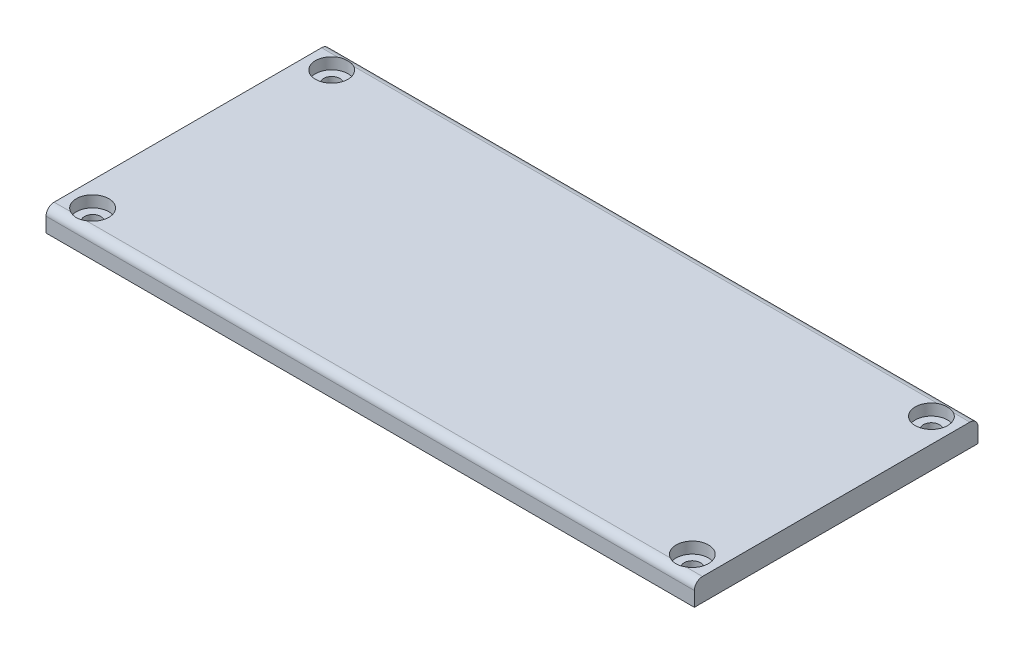
ISO-10303-21;
HEADER;
FILE_DESCRIPTION(('STEP AP214'),'2;1');
FILE_NAME('part.step','',(''),(''),'','','');
FILE_SCHEMA(('AUTOMOTIVE_DESIGN { 1 0 10303 214 1 1 1 1 }'));
ENDSEC;
DATA;
#1=APPLICATION_CONTEXT('core data for automotive mechanical design processes');
#2=APPLICATION_PROTOCOL_DEFINITION('international standard','automotive_design',2000,#1);
#3=PRODUCT_CONTEXT('',#1,'mechanical');
#4=PRODUCT('Part','Part','',(#3));
#5=PRODUCT_RELATED_PRODUCT_CATEGORY('part','',(#4));
#6=PRODUCT_DEFINITION_FORMATION('','',#4);
#7=PRODUCT_DEFINITION_CONTEXT('part definition',#1,'design');
#8=PRODUCT_DEFINITION('design','',#6,#7);
#9=PRODUCT_DEFINITION_SHAPE('','',#8);
#10=(LENGTH_UNIT() NAMED_UNIT(*) SI_UNIT(.MILLI.,.METRE.));
#11=(NAMED_UNIT(*) PLANE_ANGLE_UNIT() SI_UNIT($,.RADIAN.));
#12=(NAMED_UNIT(*) SI_UNIT($,.STERADIAN.) SOLID_ANGLE_UNIT());
#13=UNCERTAINTY_MEASURE_WITH_UNIT(LENGTH_MEASURE(1.E-05),#10,'distance_accuracy_value','');
#14=(GEOMETRIC_REPRESENTATION_CONTEXT(3) GLOBAL_UNCERTAINTY_ASSIGNED_CONTEXT((#13)) GLOBAL_UNIT_ASSIGNED_CONTEXT((#10,
#11,#12)) REPRESENTATION_CONTEXT('',''));
#15=CARTESIAN_POINT('',(0.,0.,0.));
#16=DIRECTION('',(0.,0.,1.));
#17=DIRECTION('',(1.,0.,0.));
#18=AXIS2_PLACEMENT_3D('',#15,#16,#17);
#19=CARTESIAN_POINT('',(-21.1045649137268,1.4,-6.99518001551933));
#20=DIRECTION('',(1.,0.,0.));
#21=DIRECTION('',(0.,0.,-1.));
#22=AXIS2_PLACEMENT_3D('',#19,#20,#21);
#23=PLANE('',#22);
#24=DIRECTION('',(0.,-1.,0.));
#25=VECTOR('',#24,1.);
#26=CARTESIAN_POINT('',(-21.1045649137268,1.4,10.5048199844807));
#27=LINE('',#26,#25);
#28=CARTESIAN_POINT('',(-21.1045649137268,0.9,10.5048199844807));
#29=VERTEX_POINT('',#28);
#30=CARTESIAN_POINT('',(-21.1045649137268,0.,10.5048199844807));
#31=VERTEX_POINT('',#30);
#32=EDGE_CURVE('E173',#29,#31,#27,.T.);
#33=ORIENTED_EDGE('',*,*,#32,.F.);
#34=CARTESIAN_POINT('',(-21.1045649137268,0.9,10.0048199844807));
#35=DIRECTION('',(1.,0.,0.));
#36=DIRECTION('',(0.,0.,-1.));
#37=AXIS2_PLACEMENT_3D('',#34,#35,#36);
#38=CIRCLE('',#37,0.5);
#39=CARTESIAN_POINT('',(-21.1045649137268,1.4,10.0048199844807));
#40=VERTEX_POINT('',#39);
#41=EDGE_CURVE('E12',#29,#40,#38,.F.);
#42=ORIENTED_EDGE('',*,*,#41,.T.);
#43=DIRECTION('',(0.,0.,1.));
#44=VECTOR('',#43,1.);
#45=CARTESIAN_POINT('',(-21.1045649137268,1.4,-6.99518001551933));
#46=LINE('',#45,#44);
#47=CARTESIAN_POINT('',(-21.1045649137268,1.4,-6.49518001551933));
#48=VERTEX_POINT('',#47);
#49=EDGE_CURVE('E207',#48,#40,#46,.T.);
#50=ORIENTED_EDGE('',*,*,#49,.F.);
#51=CARTESIAN_POINT('',(-21.1045649137268,0.9,-6.49518001551933));
#52=DIRECTION('',(1.,0.,0.));
#53=DIRECTION('',(0.,0.,-1.));
#54=AXIS2_PLACEMENT_3D('',#51,#52,#53);
#55=CIRCLE('',#54,0.5);
#56=CARTESIAN_POINT('',(-21.1045649137268,0.9,-6.99518001551933));
#57=VERTEX_POINT('',#56);
#58=EDGE_CURVE('E368',#48,#57,#55,.F.);
#59=ORIENTED_EDGE('',*,*,#58,.T.);
#60=DIRECTION('',(0.,-1.,0.));
#61=VECTOR('',#60,1.);
#62=CARTESIAN_POINT('',(-21.1045649137268,1.4,-6.99518001551933));
#63=LINE('',#62,#61);
#64=CARTESIAN_POINT('',(-21.1045649137268,0.,-6.99518001551933));
#65=VERTEX_POINT('',#64);
#66=EDGE_CURVE('E193',#57,#65,#63,.T.);
#67=ORIENTED_EDGE('',*,*,#66,.T.);
#68=DIRECTION('',(0.,0.,1.));
#69=VECTOR('',#68,1.);
#70=CARTESIAN_POINT('',(-21.1045649137268,0.,-6.99518001551933));
#71=LINE('',#70,#69);
#72=EDGE_CURVE('E188',#65,#31,#71,.T.);
#73=ORIENTED_EDGE('',*,*,#72,.T.);
#74=EDGE_LOOP('',(#33,#42,#50,#59,#67,#73));
#75=FACE_BOUND('',#74,.T.);
#76=ADVANCED_FACE('F98',(#75),#23,.F.);
#77=CARTESIAN_POINT('',(-21.1045649137268,1.4,10.5048199844807));
#78=DIRECTION('',(0.,0.,-1.));
#79=DIRECTION('',(-1.,0.,0.));
#80=AXIS2_PLACEMENT_3D('',#77,#78,#79);
#81=PLANE('',#80);
#82=DIRECTION('',(0.,-1.,0.));
#83=VECTOR('',#82,1.);
#84=CARTESIAN_POINT('',(18.8954350862732,1.4,10.5048199844807));
#85=LINE('',#84,#83);
#86=CARTESIAN_POINT('',(18.8954350862732,0.9,10.5048199844807));
#87=VERTEX_POINT('',#86);
#88=CARTESIAN_POINT('',(18.8954350862732,0.,10.5048199844807));
#89=VERTEX_POINT('',#88);
#90=EDGE_CURVE('E182',#87,#89,#85,.T.);
#91=ORIENTED_EDGE('',*,*,#90,.F.);
#92=DIRECTION('',(1.,0.,0.));
#93=VECTOR('',#92,1.);
#94=CARTESIAN_POINT('',(-21.1045649137268,0.9,10.5048199844807));
#95=LINE('',#94,#93);
#96=EDGE_CURVE('E107',#87,#29,#95,.F.);
#97=ORIENTED_EDGE('',*,*,#96,.T.);
#98=ORIENTED_EDGE('',*,*,#32,.T.);
#99=DIRECTION('',(1.,0.,0.));
#100=VECTOR('',#99,1.);
#101=CARTESIAN_POINT('',(-21.1045649137268,0.,10.5048199844807));
#102=LINE('',#101,#100);
#103=EDGE_CURVE('E176',#31,#89,#102,.T.);
#104=ORIENTED_EDGE('',*,*,#103,.T.);
#105=EDGE_LOOP('',(#91,#97,#98,#104));
#106=FACE_BOUND('',#105,.T.);
#107=ADVANCED_FACE('F175',(#106),#81,.F.);
#108=CARTESIAN_POINT('',(18.8954350862732,1.4,-6.99518001551933));
#109=DIRECTION('',(-1.,0.,0.));
#110=DIRECTION('',(0.,0.,1.));
#111=AXIS2_PLACEMENT_3D('',#108,#109,#110);
#112=PLANE('',#111);
#113=DIRECTION('',(0.,0.,-1.));
#114=VECTOR('',#113,1.);
#115=CARTESIAN_POINT('',(18.8954350862732,1.4,-6.99518001551933));
#116=LINE('',#115,#114);
#117=CARTESIAN_POINT('',(18.8954350862732,1.4,10.0048199844807));
#118=VERTEX_POINT('',#117);
#119=CARTESIAN_POINT('',(18.8954350862732,1.4,-6.49518001551933));
#120=VERTEX_POINT('',#119);
#121=EDGE_CURVE('E201',#118,#120,#116,.T.);
#122=ORIENTED_EDGE('',*,*,#121,.F.);
#123=CARTESIAN_POINT('',(18.8954350862732,0.9,10.0048199844807));
#124=DIRECTION('',(-1.,0.,0.));
#125=DIRECTION('',(0.,0.,1.));
#126=AXIS2_PLACEMENT_3D('',#123,#124,#125);
#127=CIRCLE('',#126,0.5);
#128=EDGE_CURVE('E121',#118,#87,#127,.F.);
#129=ORIENTED_EDGE('',*,*,#128,.T.);
#130=ORIENTED_EDGE('',*,*,#90,.T.);
#131=DIRECTION('',(0.,0.,-1.));
#132=VECTOR('',#131,1.);
#133=CARTESIAN_POINT('',(18.8954350862732,0.,-6.99518001551933));
#134=LINE('',#133,#132);
#135=CARTESIAN_POINT('',(18.8954350862732,0.,-6.99518001551933));
#136=VERTEX_POINT('',#135);
#137=EDGE_CURVE('E190',#89,#136,#134,.T.);
#138=ORIENTED_EDGE('',*,*,#137,.T.);
#139=DIRECTION('',(0.,-1.,0.));
#140=VECTOR('',#139,1.);
#141=CARTESIAN_POINT('',(18.8954350862732,1.4,-6.99518001551933));
#142=LINE('',#141,#140);
#143=CARTESIAN_POINT('',(18.8954350862732,0.9,-6.99518001551933));
#144=VERTEX_POINT('',#143);
#145=EDGE_CURVE('E209',#144,#136,#142,.T.);
#146=ORIENTED_EDGE('',*,*,#145,.F.);
#147=CARTESIAN_POINT('',(18.8954350862732,0.9,-6.49518001551933));
#148=DIRECTION('',(-1.,0.,0.));
#149=DIRECTION('',(0.,0.,1.));
#150=AXIS2_PLACEMENT_3D('',#147,#148,#149);
#151=CIRCLE('',#150,0.5);
#152=EDGE_CURVE('E357',#144,#120,#151,.F.);
#153=ORIENTED_EDGE('',*,*,#152,.T.);
#154=EDGE_LOOP('',(#122,#129,#130,#138,#146,#153));
#155=FACE_BOUND('',#154,.T.);
#156=ADVANCED_FACE('F245',(#155),#112,.F.);
#157=CARTESIAN_POINT('',(-21.1045649137268,1.4,-6.99518001551933));
#158=DIRECTION('',(0.,0.,1.));
#159=DIRECTION('',(1.,0.,0.));
#160=AXIS2_PLACEMENT_3D('',#157,#158,#159);
#161=PLANE('',#160);
#162=ORIENTED_EDGE('',*,*,#66,.F.);
#163=DIRECTION('',(-1.,0.,0.));
#164=VECTOR('',#163,1.);
#165=CARTESIAN_POINT('',(18.8954350862732,0.9,-6.99518001551933));
#166=LINE('',#165,#164);
#167=EDGE_CURVE('E359',#57,#144,#166,.F.);
#168=ORIENTED_EDGE('',*,*,#167,.T.);
#169=ORIENTED_EDGE('',*,*,#145,.T.);
#170=DIRECTION('',(-1.,0.,0.));
#171=VECTOR('',#170,1.);
#172=CARTESIAN_POINT('',(-21.1045649137268,0.,-6.99518001551933));
#173=LINE('',#172,#171);
#174=EDGE_CURVE('E205',#136,#65,#173,.T.);
#175=ORIENTED_EDGE('',*,*,#174,.T.);
#176=EDGE_LOOP('',(#162,#168,#169,#175));
#177=FACE_BOUND('',#176,.T.);
#178=ADVANCED_FACE('F248',(#177),#161,.F.);
#179=CARTESIAN_POINT('',(0.,1.4,0.));
#180=DIRECTION('',(0.,1.,0.));
#181=DIRECTION('',(0.,0.,1.));
#182=AXIS2_PLACEMENT_3D('',#179,#180,#181);
#183=PLANE('',#182);
#184=ORIENTED_EDGE('',*,*,#49,.T.);
#185=DIRECTION('',(1.,0.,0.));
#186=VECTOR('',#185,1.);
#187=CARTESIAN_POINT('',(18.8954350862732,1.4,10.0048199844807));
#188=LINE('',#187,#186);
#189=CARTESIAN_POINT('',(-20.0886878320027,1.4,10.0048199844807));
#190=VERTEX_POINT('',#189);
#191=EDGE_CURVE('E285',#40,#190,#188,.T.);
#192=ORIENTED_EDGE('',*,*,#191,.T.);
#193=CARTESIAN_POINT('',(-19.6045649137268,1.4,9.12981998448067));
#194=DIRECTION('',(0.,-1.,0.));
#195=DIRECTION('',(0.,0.,-1.));
#196=AXIS2_PLACEMENT_3D('',#193,#194,#195);
#197=CIRCLE('',#196,1.);
#198=CARTESIAN_POINT('',(-19.1204419954508,1.4,10.0048199844807));
#199=VERTEX_POINT('',#198);
#200=EDGE_CURVE('E332',#190,#199,#197,.T.);
#201=ORIENTED_EDGE('',*,*,#200,.T.);
#202=DIRECTION('',(1.,0.,0.));
#203=VECTOR('',#202,1.);
#204=CARTESIAN_POINT('',(18.8954350862732,1.4,10.0048199844807));
#205=LINE('',#204,#203);
#206=CARTESIAN_POINT('',(16.9113121679973,1.4,10.0048199844807));
#207=VERTEX_POINT('',#206);
#208=EDGE_CURVE('E371',#199,#207,#205,.T.);
#209=ORIENTED_EDGE('',*,*,#208,.T.);
#210=CARTESIAN_POINT('',(17.3954350862732,1.4,9.12981998448067));
#211=DIRECTION('',(0.,1.,0.));
#212=DIRECTION('',(0.,0.,-1.));
#213=AXIS2_PLACEMENT_3D('',#210,#211,#212);
#214=CIRCLE('',#213,1.);
#215=CARTESIAN_POINT('',(17.8795580045492,1.4,10.0048199844807));
#216=VERTEX_POINT('',#215);
#217=EDGE_CURVE('E379',#216,#207,#214,.T.);
#218=ORIENTED_EDGE('',*,*,#217,.F.);
#219=DIRECTION('',(1.,0.,0.));
#220=VECTOR('',#219,1.);
#221=CARTESIAN_POINT('',(18.8954350862732,1.4,10.0048199844807));
#222=LINE('',#221,#220);
#223=EDGE_CURVE('E354',#216,#118,#222,.T.);
#224=ORIENTED_EDGE('',*,*,#223,.T.);
#225=ORIENTED_EDGE('',*,*,#121,.T.);
#226=DIRECTION('',(-1.,0.,0.));
#227=VECTOR('',#226,1.);
#228=CARTESIAN_POINT('',(-21.1045649137268,1.4,-6.49518001551933));
#229=LINE('',#228,#227);
#230=CARTESIAN_POINT('',(17.8795580045492,1.4,-6.49518001551933));
#231=VERTEX_POINT('',#230);
#232=EDGE_CURVE('E215',#120,#231,#229,.T.);
#233=ORIENTED_EDGE('',*,*,#232,.T.);
#234=CARTESIAN_POINT('',(17.3954350862732,1.4,-5.62018001551933));
#235=DIRECTION('',(0.,-1.,0.));
#236=DIRECTION('',(0.,0.,1.));
#237=AXIS2_PLACEMENT_3D('',#234,#235,#236);
#238=CIRCLE('',#237,1.);
#239=CARTESIAN_POINT('',(16.9113121679973,1.4,-6.49518001551933));
#240=VERTEX_POINT('',#239);
#241=EDGE_CURVE('E319',#231,#240,#238,.T.);
#242=ORIENTED_EDGE('',*,*,#241,.T.);
#243=DIRECTION('',(-1.,0.,0.));
#244=VECTOR('',#243,1.);
#245=CARTESIAN_POINT('',(-21.1045649137268,1.4,-6.49518001551933));
#246=LINE('',#245,#244);
#247=CARTESIAN_POINT('',(-19.1204419954508,1.4,-6.49518001551933));
#248=VERTEX_POINT('',#247);
#249=EDGE_CURVE('E213',#240,#248,#246,.T.);
#250=ORIENTED_EDGE('',*,*,#249,.T.);
#251=CARTESIAN_POINT('',(-19.6045649137268,1.4,-5.62018001551933));
#252=DIRECTION('',(0.,1.,0.));
#253=DIRECTION('',(0.,0.,1.));
#254=AXIS2_PLACEMENT_3D('',#251,#252,#253);
#255=CIRCLE('',#254,1.);
#256=CARTESIAN_POINT('',(-20.0886878320027,1.4,-6.49518001551933));
#257=VERTEX_POINT('',#256);
#258=EDGE_CURVE('E198',#257,#248,#255,.T.);
#259=ORIENTED_EDGE('',*,*,#258,.F.);
#260=DIRECTION('',(-1.,0.,0.));
#261=VECTOR('',#260,1.);
#262=CARTESIAN_POINT('',(-21.1045649137268,1.4,-6.49518001551933));
#263=LINE('',#262,#261);
#264=EDGE_CURVE('E181',#257,#48,#263,.T.);
#265=ORIENTED_EDGE('',*,*,#264,.T.);
#266=EDGE_LOOP('',(#184,#192,#201,#209,#218,#224,#225,#233,#242,#250,#259,#265));
#267=FACE_BOUND('',#266,.T.);
#268=ADVANCED_FACE('F251',(#267),#183,.T.);
#269=CARTESIAN_POINT('',(0.,0.,0.));
#270=DIRECTION('',(0.,1.,0.));
#271=DIRECTION('',(0.,0.,1.));
#272=AXIS2_PLACEMENT_3D('',#269,#270,#271);
#273=PLANE('',#272);
#274=CARTESIAN_POINT('',(17.3954350862732,0.,9.12981998448067));
#275=DIRECTION('',(0.,1.,0.));
#276=DIRECTION('',(0.,0.,1.));
#277=AXIS2_PLACEMENT_3D('',#274,#275,#276);
#278=CIRCLE('',#277,0.499999999999999);
#279=CARTESIAN_POINT('',(17.3954350862732,0.,9.62981998448067));
#280=VERTEX_POINT('',#279);
#281=EDGE_CURVE('E381',#280,#280,#278,.T.);
#282=ORIENTED_EDGE('',*,*,#281,.T.);
#283=EDGE_LOOP('',(#282));
#284=FACE_BOUND('',#283,.T.);
#285=CARTESIAN_POINT('',(17.3954350862732,0.,-5.62018001551933));
#286=DIRECTION('',(0.,1.,0.));
#287=DIRECTION('',(0.,0.,1.));
#288=AXIS2_PLACEMENT_3D('',#285,#286,#287);
#289=CIRCLE('',#288,0.499999999999999);
#290=CARTESIAN_POINT('',(17.3954350862732,0.,-5.12018001551933));
#291=VERTEX_POINT('',#290);
#292=EDGE_CURVE('E325',#291,#291,#289,.F.);
#293=ORIENTED_EDGE('',*,*,#292,.F.);
#294=EDGE_LOOP('',(#293));
#295=FACE_BOUND('',#294,.T.);
#296=CARTESIAN_POINT('',(-19.6045649137268,0.,9.12981998448067));
#297=DIRECTION('',(0.,1.,0.));
#298=DIRECTION('',(0.,0.,1.));
#299=AXIS2_PLACEMENT_3D('',#296,#297,#298);
#300=CIRCLE('',#299,0.499999999999999);
#301=CARTESIAN_POINT('',(-19.6045649137268,0.,9.62981998448067));
#302=VERTEX_POINT('',#301);
#303=EDGE_CURVE('E322',#302,#302,#300,.F.);
#304=ORIENTED_EDGE('',*,*,#303,.F.);
#305=EDGE_LOOP('',(#304));
#306=FACE_BOUND('',#305,.T.);
#307=CARTESIAN_POINT('',(-19.6045649137268,0.,-5.62018001551933));
#308=DIRECTION('',(0.,1.,0.));
#309=DIRECTION('',(0.,0.,1.));
#310=AXIS2_PLACEMENT_3D('',#307,#308,#309);
#311=CIRCLE('',#310,0.499999999999999);
#312=CARTESIAN_POINT('',(-19.6045649137268,0.,-5.12018001551933));
#313=VERTEX_POINT('',#312);
#314=EDGE_CURVE('E341',#313,#313,#311,.T.);
#315=ORIENTED_EDGE('',*,*,#314,.T.);
#316=EDGE_LOOP('',(#315));
#317=FACE_BOUND('',#316,.T.);
#318=ORIENTED_EDGE('',*,*,#72,.F.);
#319=ORIENTED_EDGE('',*,*,#174,.F.);
#320=ORIENTED_EDGE('',*,*,#137,.F.);
#321=ORIENTED_EDGE('',*,*,#103,.F.);
#322=EDGE_LOOP('',(#318,#319,#320,#321));
#323=FACE_BOUND('',#322,.T.);
#324=ADVANCED_FACE('F186',(#284,#295,#306,#317,#323),#273,.F.);
#325=CARTESIAN_POINT('',(-19.6045649137268,0.7,-5.62018001551933));
#326=DIRECTION('',(0.,1.,0.));
#327=DIRECTION('',(0.,0.,1.));
#328=AXIS2_PLACEMENT_3D('',#325,#326,#327);
#329=CYLINDRICAL_SURFACE('',#328,1.);
#330=CARTESIAN_POINT('',(-19.6045649137268,0.7,-5.62018001551933));
#331=DIRECTION('',(0.,1.,0.));
#332=DIRECTION('',(0.,0.,1.));
#333=AXIS2_PLACEMENT_3D('',#330,#331,#332);
#334=CIRCLE('',#333,1.);
#335=CARTESIAN_POINT('',(-19.6045649137268,0.7,-4.62018001551933));
#336=VERTEX_POINT('',#335);
#337=EDGE_CURVE('E195',#336,#336,#334,.T.);
#338=ORIENTED_EDGE('',*,*,#337,.F.);
#339=EDGE_LOOP('',(#338));
#340=FACE_BOUND('',#339,.T.);
#341=ORIENTED_EDGE('',*,*,#258,.T.);
#342=CARTESIAN_POINT('',(-19.1204419954508,1.4,-6.49518001551933));
#343=CARTESIAN_POINT('',(-19.1445879332908,1.39998974413526,-6.50854210294463));
#344=CARTESIAN_POINT('',(-19.1692778568295,1.39946448474708,-6.52089457041051));
#345=CARTESIAN_POINT('',(-19.2195692438282,1.39779049582453,-6.54350938798196));
#346=CARTESIAN_POINT('',(-19.2451704232282,1.39664195901738,-6.55377238283716));
#347=CARTESIAN_POINT('',(-19.2970774230511,1.39412965070228,-6.57212959293032));
#348=CARTESIAN_POINT('',(-19.3233819276203,1.39276626056713,-6.58022758372311));
#349=CARTESIAN_POINT('',(-19.3765677971149,1.39014160609788,-6.59423058936994));
#350=CARTESIAN_POINT('',(-19.4034491895771,1.38888034665261,-6.60013549929351));
#351=CARTESIAN_POINT('',(-19.4852408811027,1.38564340666151,-6.61458453044204));
#352=CARTESIAN_POINT('',(-19.5408266534271,1.38424752730245,-6.61969592620512));
#353=CARTESIAN_POINT('',(-19.6520841091063,1.38401528750251,-6.62059833923553));
#354=CARTESIAN_POINT('',(-19.7077557996667,1.38517915486502,-6.6163885269663));
#355=CARTESIAN_POINT('',(-19.7911090052383,1.3882424702987,-6.60305210143303));
#356=CARTESIAN_POINT('',(-19.8193891133225,1.38951996193624,-6.59725898700355));
#357=CARTESIAN_POINT('',(-19.8753434073437,1.39223468864341,-6.58325310619814));
#358=CARTESIAN_POINT('',(-19.9030175803742,1.39367192711169,-6.57504028833623));
#359=CARTESIAN_POINT('',(-19.9576235942742,1.39635077219216,-6.55622771728579));
#360=CARTESIAN_POINT('',(-19.9845535988334,1.39759192530831,-6.54562256476342));
#361=CARTESIAN_POINT('',(-20.0374179812289,1.39941037147826,-6.52210942785793));
#362=CARTESIAN_POINT('',(-20.0633521105882,1.39998749988079,-6.50920087324042));
#363=CARTESIAN_POINT('',(-20.0886878320027,1.4,-6.49518001551933));
#364=B_SPLINE_CURVE_WITH_KNOTS('',3,(#342,#343,#344,#345,#346,#347,#348,#349,#350,#351,#352,
#353,#354,#355,#356,#357,#358,#359,#360,#361,#362,#363),.UNSPECIFIED.,.F.,.F.,(4,2,2,2,2,2,2,2,
2,2,4),(0.,0.0827434879898214,0.165461404952534,0.248034114858824,0.330610775042443,
0.497250851029685,0.663905757668905,0.750501327398481,0.837098739825004,0.923893587526274,
1.0107099522031),.UNSPECIFIED.);
#365=EDGE_CURVE('E224',#248,#257,#364,.T.);
#366=ORIENTED_EDGE('',*,*,#365,.T.);
#367=EDGE_LOOP('',(#341,#366));
#368=FACE_BOUND('',#367,.T.);
#369=ADVANCED_FACE('F255',(#340,#368),#329,.F.);
#370=CARTESIAN_POINT('',(-19.6045649137268,0.7,-5.62018001551933));
#371=DIRECTION('',(0.,1.,0.));
#372=DIRECTION('',(0.,0.,1.));
#373=AXIS2_PLACEMENT_3D('',#370,#371,#372);
#374=PLANE('',#373);
#375=CARTESIAN_POINT('',(-19.6045649137268,0.7,-5.62018001551933));
#376=DIRECTION('',(0.,1.,0.));
#377=DIRECTION('',(0.,0.,1.));
#378=AXIS2_PLACEMENT_3D('',#375,#376,#377);
#379=CIRCLE('',#378,0.499999999999999);
#380=CARTESIAN_POINT('',(-19.6045649137268,0.7,-5.12018001551933));
#381=VERTEX_POINT('',#380);
#382=EDGE_CURVE('E336',#381,#381,#379,.T.);
#383=ORIENTED_EDGE('',*,*,#382,.F.);
#384=EDGE_LOOP('',(#383));
#385=FACE_BOUND('',#384,.T.);
#386=ORIENTED_EDGE('',*,*,#337,.T.);
#387=EDGE_LOOP('',(#386));
#388=FACE_BOUND('',#387,.T.);
#389=ADVANCED_FACE('F262',(#385,#388),#374,.T.);
#390=CARTESIAN_POINT('',(-19.6045649137268,-0.8,-5.62018001551933));
#391=DIRECTION('',(0.,1.,0.));
#392=DIRECTION('',(0.,0.,1.));
#393=AXIS2_PLACEMENT_3D('',#390,#391,#392);
#394=CYLINDRICAL_SURFACE('',#393,0.499999999999999);
#395=ORIENTED_EDGE('',*,*,#382,.T.);
#396=EDGE_LOOP('',(#395));
#397=FACE_BOUND('',#396,.T.);
#398=ORIENTED_EDGE('',*,*,#314,.F.);
#399=EDGE_LOOP('',(#398));
#400=FACE_BOUND('',#399,.T.);
#401=ADVANCED_FACE('F266',(#397,#400),#394,.F.);
#402=CARTESIAN_POINT('',(-19.6045649137268,0.7,9.12981998448067));
#403=DIRECTION('',(0.,1.,0.));
#404=DIRECTION('',(0.,0.,1.));
#405=AXIS2_PLACEMENT_3D('',#402,#403,#404);
#406=CYLINDRICAL_SURFACE('',#405,1.);
#407=CARTESIAN_POINT('',(-19.6045649137268,0.7,9.12981998448067));
#408=DIRECTION('',(0.,-1.,0.));
#409=DIRECTION('',(0.,0.,-1.));
#410=AXIS2_PLACEMENT_3D('',#407,#408,#409);
#411=CIRCLE('',#410,1.);
#412=CARTESIAN_POINT('',(-19.6045649137268,0.7,8.12981998448067));
#413=VERTEX_POINT('',#412);
#414=EDGE_CURVE('E333',#413,#413,#411,.T.);
#415=ORIENTED_EDGE('',*,*,#414,.T.);
#416=EDGE_LOOP('',(#415));
#417=FACE_BOUND('',#416,.T.);
#418=ORIENTED_EDGE('',*,*,#200,.F.);
#419=CARTESIAN_POINT('',(-20.0886878320027,1.4,10.0048199844807));
#420=CARTESIAN_POINT('',(-20.0645418941627,1.39998974413526,10.018182071906));
#421=CARTESIAN_POINT('',(-20.039851970624,1.39946448474708,10.0305345393718));
#422=CARTESIAN_POINT('',(-19.9895605836253,1.39779049582453,10.0531493569433));
#423=CARTESIAN_POINT('',(-19.9639594042253,1.39664195901739,10.0634123517985));
#424=CARTESIAN_POINT('',(-19.9120524044024,1.39412965070229,10.0817695618917));
#425=CARTESIAN_POINT('',(-19.8857478998332,1.39276626056713,10.0898675526844));
#426=CARTESIAN_POINT('',(-19.8325620303386,1.39014160609788,10.1038705583313));
#427=CARTESIAN_POINT('',(-19.8056806378764,1.38888034665261,10.1097754682548));
#428=CARTESIAN_POINT('',(-19.7238889463508,1.38564340666151,10.1242244994034));
#429=CARTESIAN_POINT('',(-19.6683031740264,1.38424752730245,10.1293358951665));
#430=CARTESIAN_POINT('',(-19.5570457183472,1.38401528750251,10.1302383081969));
#431=CARTESIAN_POINT('',(-19.5013740277868,1.38517915486502,10.1260284959276));
#432=CARTESIAN_POINT('',(-19.4180208222152,1.3882424702987,10.1126920703944));
#433=CARTESIAN_POINT('',(-19.389740714131,1.38951996193624,10.1068989559649));
#434=CARTESIAN_POINT('',(-19.3337864201098,1.39223468864341,10.0928930751595));
#435=CARTESIAN_POINT('',(-19.3061122470793,1.39367192711169,10.0846802572976));
#436=CARTESIAN_POINT('',(-19.2515062331793,1.39635077219216,10.0658676862471));
#437=CARTESIAN_POINT('',(-19.2245762286201,1.39759192530831,10.0552625337248));
#438=CARTESIAN_POINT('',(-19.1717118462246,1.39941037147826,10.0317493968193));
#439=CARTESIAN_POINT('',(-19.1457777168653,1.39998749988079,10.0188408422018));
#440=CARTESIAN_POINT('',(-19.1204419954508,1.4,10.0048199844807));
#441=B_SPLINE_CURVE_WITH_KNOTS('',3,(#419,#420,#421,#422,#423,#424,#425,#426,#427,#428,#429,
#430,#431,#432,#433,#434,#435,#436,#437,#438,#439,#440),.UNSPECIFIED.,.F.,.F.,(4,2,2,2,2,2,2,2,
2,2,4),(0.,0.0827434879898253,0.165461404952534,0.248034114858827,0.330610775042444,
0.497250851029685,0.663905757668902,0.750501327398478,0.837098739825007,0.923893587526278,
1.01070995220311),.UNSPECIFIED.);
#442=EDGE_CURVE('E278',#190,#199,#441,.T.);
#443=ORIENTED_EDGE('',*,*,#442,.T.);
#444=EDGE_LOOP('',(#418,#443));
#445=FACE_BOUND('',#444,.T.);
#446=ADVANCED_FACE('F270',(#417,#445),#406,.F.);
#447=CARTESIAN_POINT('',(-19.6045649137268,0.7,9.12981998448067));
#448=DIRECTION('',(0.,1.,0.));
#449=DIRECTION('',(0.,0.,-1.));
#450=AXIS2_PLACEMENT_3D('',#447,#448,#449);
#451=PLANE('',#450);
#452=CARTESIAN_POINT('',(-19.6045649137268,0.7,9.12981998448067));
#453=DIRECTION('',(0.,-1.,0.));
#454=DIRECTION('',(0.,0.,-1.));
#455=AXIS2_PLACEMENT_3D('',#452,#453,#454);
#456=CIRCLE('',#455,0.499999999999999);
#457=CARTESIAN_POINT('',(-19.6045649137268,0.7,8.62981998448067));
#458=VERTEX_POINT('',#457);
#459=EDGE_CURVE('E318',#458,#458,#456,.T.);
#460=ORIENTED_EDGE('',*,*,#459,.T.);
#461=EDGE_LOOP('',(#460));
#462=FACE_BOUND('',#461,.T.);
#463=ORIENTED_EDGE('',*,*,#414,.F.);
#464=EDGE_LOOP('',(#463));
#465=FACE_BOUND('',#464,.T.);
#466=ADVANCED_FACE('F275',(#462,#465),#451,.T.);
#467=CARTESIAN_POINT('',(-19.6045649137268,-0.8,9.12981998448067));
#468=DIRECTION('',(0.,1.,0.));
#469=DIRECTION('',(0.,0.,1.));
#470=AXIS2_PLACEMENT_3D('',#467,#468,#469);
#471=CYLINDRICAL_SURFACE('',#470,0.499999999999999);
#472=ORIENTED_EDGE('',*,*,#459,.F.);
#473=EDGE_LOOP('',(#472));
#474=FACE_BOUND('',#473,.T.);
#475=ORIENTED_EDGE('',*,*,#303,.T.);
#476=EDGE_LOOP('',(#475));
#477=FACE_BOUND('',#476,.T.);
#478=ADVANCED_FACE('F309',(#474,#477),#471,.F.);
#479=CARTESIAN_POINT('',(17.3954350862732,0.7,-5.62018001551933));
#480=DIRECTION('',(0.,1.,0.));
#481=DIRECTION('',(0.,0.,1.));
#482=AXIS2_PLACEMENT_3D('',#479,#480,#481);
#483=CYLINDRICAL_SURFACE('',#482,1.);
#484=CARTESIAN_POINT('',(17.3954350862732,0.7,-5.62018001551933));
#485=DIRECTION('',(0.,-1.,0.));
#486=DIRECTION('',(0.,0.,1.));
#487=AXIS2_PLACEMENT_3D('',#484,#485,#486);
#488=CIRCLE('',#487,1.);
#489=CARTESIAN_POINT('',(17.3954350862732,0.7,-4.62018001551933));
#490=VERTEX_POINT('',#489);
#491=EDGE_CURVE('E317',#490,#490,#488,.T.);
#492=ORIENTED_EDGE('',*,*,#491,.T.);
#493=EDGE_LOOP('',(#492));
#494=FACE_BOUND('',#493,.T.);
#495=ORIENTED_EDGE('',*,*,#241,.F.);
#496=CARTESIAN_POINT('',(17.8795580045492,1.4,-6.49518001551933));
#497=CARTESIAN_POINT('',(17.8554120667092,1.39998974413526,-6.50854210294463));
#498=CARTESIAN_POINT('',(17.8307221431705,1.39946448474708,-6.52089457041051));
#499=CARTESIAN_POINT('',(17.7804307561718,1.39779049582453,-6.54350938798196));
#500=CARTESIAN_POINT('',(17.7548295767718,1.39664195901738,-6.55377238283716));
#501=CARTESIAN_POINT('',(17.7029225769489,1.39412965070228,-6.57212959293032));
#502=CARTESIAN_POINT('',(17.6766180723797,1.39276626056713,-6.58022758372311));
#503=CARTESIAN_POINT('',(17.6234322028851,1.39014160609788,-6.59423058936994));
#504=CARTESIAN_POINT('',(17.5965508104229,1.38888034665261,-6.60013549929351));
#505=CARTESIAN_POINT('',(17.5147591188973,1.38564340666151,-6.61458453044204));
#506=CARTESIAN_POINT('',(17.4591733465729,1.38424752730245,-6.61969592620512));
#507=CARTESIAN_POINT('',(17.3479158908937,1.38401528750251,-6.62059833923553));
#508=CARTESIAN_POINT('',(17.2922442003333,1.38517915486502,-6.6163885269663));
#509=CARTESIAN_POINT('',(17.2088909947617,1.3882424702987,-6.60305210143303));
#510=CARTESIAN_POINT('',(17.1806108866775,1.38951996193624,-6.59725898700355));
#511=CARTESIAN_POINT('',(17.1246565926563,1.39223468864341,-6.58325310619814));
#512=CARTESIAN_POINT('',(17.0969824196258,1.39367192711169,-6.57504028833623));
#513=CARTESIAN_POINT('',(17.0423764057258,1.39635077219216,-6.55622771728579));
#514=CARTESIAN_POINT('',(17.0154464011666,1.39759192530831,-6.54562256476342));
#515=CARTESIAN_POINT('',(16.9625820187711,1.39941037147826,-6.52210942785793));
#516=CARTESIAN_POINT('',(16.9366478894118,1.39998749988079,-6.50920087324042));
#517=CARTESIAN_POINT('',(16.9113121679973,1.4,-6.49518001551933));
#518=B_SPLINE_CURVE_WITH_KNOTS('',3,(#496,#497,#498,#499,#500,#501,#502,#503,#504,#505,#506,
#507,#508,#509,#510,#511,#512,#513,#514,#515,#516,#517),.UNSPECIFIED.,.F.,.F.,(4,2,2,2,2,2,2,2,
2,2,4),(0.,0.0827434879898214,0.165461404952534,0.248034114858824,0.330610775042443,
0.497250851029681,0.663905757668905,0.750501327398481,0.837098739825004,0.923893587526274,
1.0107099522031),.UNSPECIFIED.);
#519=EDGE_CURVE('E218',#231,#240,#518,.T.);
#520=ORIENTED_EDGE('',*,*,#519,.T.);
#521=EDGE_LOOP('',(#495,#520));
#522=FACE_BOUND('',#521,.T.);
#523=ADVANCED_FACE('F230',(#494,#522),#483,.F.);
#524=CARTESIAN_POINT('',(17.3954350862732,0.7,-5.62018001551933));
#525=DIRECTION('',(0.,1.,0.));
#526=DIRECTION('',(0.,0.,1.));
#527=AXIS2_PLACEMENT_3D('',#524,#525,#526);
#528=PLANE('',#527);
#529=CARTESIAN_POINT('',(17.3954350862732,0.7,-5.62018001551933));
#530=DIRECTION('',(0.,-1.,0.));
#531=DIRECTION('',(0.,0.,1.));
#532=AXIS2_PLACEMENT_3D('',#529,#530,#531);
#533=CIRCLE('',#532,0.499999999999999);
#534=CARTESIAN_POINT('',(17.3954350862732,0.7,-5.12018001551933));
#535=VERTEX_POINT('',#534);
#536=EDGE_CURVE('E314',#535,#535,#533,.T.);
#537=ORIENTED_EDGE('',*,*,#536,.T.);
#538=EDGE_LOOP('',(#537));
#539=FACE_BOUND('',#538,.T.);
#540=ORIENTED_EDGE('',*,*,#491,.F.);
#541=EDGE_LOOP('',(#540));
#542=FACE_BOUND('',#541,.T.);
#543=ADVANCED_FACE('F302',(#539,#542),#528,.T.);
#544=CARTESIAN_POINT('',(17.3954350862732,-0.8,-5.62018001551933));
#545=DIRECTION('',(0.,1.,0.));
#546=DIRECTION('',(0.,0.,1.));
#547=AXIS2_PLACEMENT_3D('',#544,#545,#546);
#548=CYLINDRICAL_SURFACE('',#547,0.499999999999999);
#549=ORIENTED_EDGE('',*,*,#536,.F.);
#550=EDGE_LOOP('',(#549));
#551=FACE_BOUND('',#550,.T.);
#552=ORIENTED_EDGE('',*,*,#292,.T.);
#553=EDGE_LOOP('',(#552));
#554=FACE_BOUND('',#553,.T.);
#555=ADVANCED_FACE('F298',(#551,#554),#548,.F.);
#556=CARTESIAN_POINT('',(17.3954350862732,0.7,9.12981998448067));
#557=DIRECTION('',(0.,1.,0.));
#558=DIRECTION('',(0.,0.,1.));
#559=AXIS2_PLACEMENT_3D('',#556,#557,#558);
#560=CYLINDRICAL_SURFACE('',#559,1.);
#561=CARTESIAN_POINT('',(17.3954350862732,0.7,9.12981998448067));
#562=DIRECTION('',(0.,1.,0.));
#563=DIRECTION('',(0.,0.,-1.));
#564=AXIS2_PLACEMENT_3D('',#561,#562,#563);
#565=CIRCLE('',#564,1.);
#566=CARTESIAN_POINT('',(17.3954350862732,0.7,8.12981998448067));
#567=VERTEX_POINT('',#566);
#568=EDGE_CURVE('E380',#567,#567,#565,.T.);
#569=ORIENTED_EDGE('',*,*,#568,.F.);
#570=EDGE_LOOP('',(#569));
#571=FACE_BOUND('',#570,.T.);
#572=ORIENTED_EDGE('',*,*,#217,.T.);
#573=CARTESIAN_POINT('',(16.9113121679973,1.4,10.0048199844807));
#574=CARTESIAN_POINT('',(16.9354581058373,1.39998974413526,10.018182071906));
#575=CARTESIAN_POINT('',(16.960148029376,1.39946448474708,10.0305345393718));
#576=CARTESIAN_POINT('',(17.0104394163747,1.39779049582453,10.0531493569433));
#577=CARTESIAN_POINT('',(17.0360405957747,1.39664195901738,10.0634123517985));
#578=CARTESIAN_POINT('',(17.0879475955976,1.39412965070228,10.0817695618917));
#579=CARTESIAN_POINT('',(17.1142521001668,1.39276626056713,10.0898675526844));
#580=CARTESIAN_POINT('',(17.1674379696614,1.39014160609788,10.1038705583313));
#581=CARTESIAN_POINT('',(17.1943193621236,1.38888034665261,10.1097754682548));
#582=CARTESIAN_POINT('',(17.2761110536492,1.38564340666151,10.1242244994034));
#583=CARTESIAN_POINT('',(17.3316968259736,1.38424752730245,10.1293358951665));
#584=CARTESIAN_POINT('',(17.4429542816528,1.38401528750251,10.1302383081969));
#585=CARTESIAN_POINT('',(17.4986259722132,1.38517915486502,10.1260284959276));
#586=CARTESIAN_POINT('',(17.5819791777848,1.3882424702987,10.1126920703944));
#587=CARTESIAN_POINT('',(17.610259285869,1.38951996193624,10.1068989559649));
#588=CARTESIAN_POINT('',(17.6662135798902,1.39223468864341,10.0928930751595));
#589=CARTESIAN_POINT('',(17.6938877529207,1.3936719271117,10.0846802572976));
#590=CARTESIAN_POINT('',(17.7484937668207,1.39635077219216,10.0658676862471));
#591=CARTESIAN_POINT('',(17.7754237713799,1.39759192530831,10.0552625337248));
#592=CARTESIAN_POINT('',(17.8282881537754,1.39941037147826,10.0317493968193));
#593=CARTESIAN_POINT('',(17.8542222831347,1.39998749988079,10.0188408422018));
#594=CARTESIAN_POINT('',(17.8795580045492,1.4,10.0048199844807));
#595=B_SPLINE_CURVE_WITH_KNOTS('',3,(#573,#574,#575,#576,#577,#578,#579,#580,#581,#582,#583,
#584,#585,#586,#587,#588,#589,#590,#591,#592,#593,#594),.UNSPECIFIED.,.F.,.F.,(4,2,2,2,2,2,2,2,
2,2,4),(0.,0.0827434879898214,0.165461404952537,0.248034114858831,0.330610775042447,
0.497250851029681,0.663905757668905,0.750501327398481,0.837098739825004,0.923893587526274,
1.0107099522031),.UNSPECIFIED.);
#596=EDGE_CURVE('E284',#207,#216,#595,.T.);
#597=ORIENTED_EDGE('',*,*,#596,.T.);
#598=EDGE_LOOP('',(#572,#597));
#599=FACE_BOUND('',#598,.T.);
#600=ADVANCED_FACE('F292',(#571,#599),#560,.F.);
#601=CARTESIAN_POINT('',(17.3954350862732,0.7,9.12981998448067));
#602=DIRECTION('',(0.,1.,0.));
#603=DIRECTION('',(0.,0.,-1.));
#604=AXIS2_PLACEMENT_3D('',#601,#602,#603);
#605=PLANE('',#604);
#606=CARTESIAN_POINT('',(17.3954350862732,0.7,9.12981998448067));
#607=DIRECTION('',(0.,1.,0.));
#608=DIRECTION('',(0.,0.,-1.));
#609=AXIS2_PLACEMENT_3D('',#606,#607,#608);
#610=CIRCLE('',#609,0.499999999999999);
#611=CARTESIAN_POINT('',(17.3954350862732,0.7,8.62981998448067));
#612=VERTEX_POINT('',#611);
#613=EDGE_CURVE('E386',#612,#612,#610,.T.);
#614=ORIENTED_EDGE('',*,*,#613,.F.);
#615=EDGE_LOOP('',(#614));
#616=FACE_BOUND('',#615,.T.);
#617=ORIENTED_EDGE('',*,*,#568,.T.);
#618=EDGE_LOOP('',(#617));
#619=FACE_BOUND('',#618,.T.);
#620=ADVANCED_FACE('F297',(#616,#619),#605,.T.);
#621=CARTESIAN_POINT('',(17.3954350862732,-0.8,9.12981998448067));
#622=DIRECTION('',(0.,1.,0.));
#623=DIRECTION('',(0.,0.,1.));
#624=AXIS2_PLACEMENT_3D('',#621,#622,#623);
#625=CYLINDRICAL_SURFACE('',#624,0.499999999999999);
#626=ORIENTED_EDGE('',*,*,#613,.T.);
#627=EDGE_LOOP('',(#626));
#628=FACE_BOUND('',#627,.T.);
#629=ORIENTED_EDGE('',*,*,#281,.F.);
#630=EDGE_LOOP('',(#629));
#631=FACE_BOUND('',#630,.T.);
#632=ADVANCED_FACE('F238',(#628,#631),#625,.F.);
#633=CARTESIAN_POINT('',(0.,0.9,-6.49518001551933));
#634=DIRECTION('',(1.,0.,0.));
#635=DIRECTION('',(0.,0.,-1.));
#636=AXIS2_PLACEMENT_3D('',#633,#634,#635);
#637=CYLINDRICAL_SURFACE('',#636,0.5);
#638=ORIENTED_EDGE('',*,*,#152,.F.);
#639=ORIENTED_EDGE('',*,*,#167,.F.);
#640=ORIENTED_EDGE('',*,*,#58,.F.);
#641=ORIENTED_EDGE('',*,*,#264,.F.);
#642=ORIENTED_EDGE('',*,*,#365,.F.);
#643=ORIENTED_EDGE('',*,*,#249,.F.);
#644=ORIENTED_EDGE('',*,*,#519,.F.);
#645=ORIENTED_EDGE('',*,*,#232,.F.);
#646=EDGE_LOOP('',(#638,#639,#640,#641,#642,#643,#644,#645));
#647=FACE_BOUND('',#646,.T.);
#648=ADVANCED_FACE('F234',(#647),#637,.T.);
#649=CARTESIAN_POINT('',(0.,0.9,10.0048199844807));
#650=DIRECTION('',(-1.,0.,0.));
#651=DIRECTION('',(0.,0.,1.));
#652=AXIS2_PLACEMENT_3D('',#649,#650,#651);
#653=CYLINDRICAL_SURFACE('',#652,0.5);
#654=ORIENTED_EDGE('',*,*,#41,.F.);
#655=ORIENTED_EDGE('',*,*,#96,.F.);
#656=ORIENTED_EDGE('',*,*,#128,.F.);
#657=ORIENTED_EDGE('',*,*,#223,.F.);
#658=ORIENTED_EDGE('',*,*,#596,.F.);
#659=ORIENTED_EDGE('',*,*,#208,.F.);
#660=ORIENTED_EDGE('',*,*,#442,.F.);
#661=ORIENTED_EDGE('',*,*,#191,.F.);
#662=EDGE_LOOP('',(#654,#655,#656,#657,#658,#659,#660,#661));
#663=FACE_BOUND('',#662,.T.);
#664=ADVANCED_FACE('F100',(#663),#653,.T.);
#665=CLOSED_SHELL('',(#76,#107,#156,#178,#268,#324,#369,#389,#401,#446,#466,#478,#523,#543,#555,
#600,#620,#632,#648,#664));
#666=MANIFOLD_SOLID_BREP('B2',#665);
#667=ADVANCED_BREP_SHAPE_REPRESENTATION('',(#18,#666),#14);
#668=SHAPE_DEFINITION_REPRESENTATION(#9,#667);
ENDSEC;
END-ISO-10303-21;
